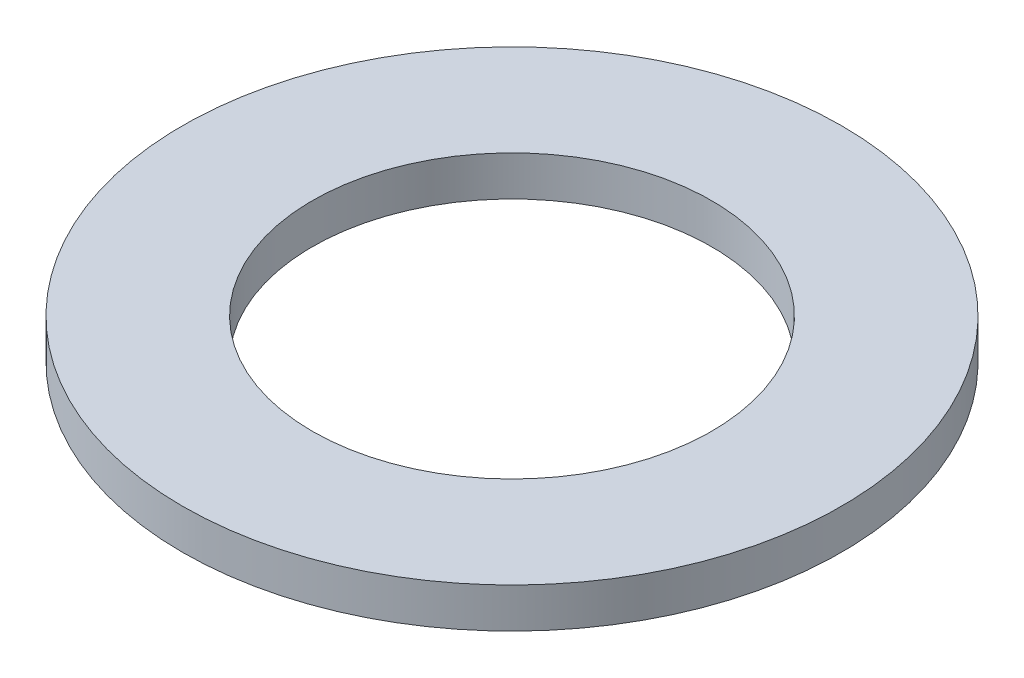
ISO-10303-21;
HEADER;
FILE_DESCRIPTION(('STEP AP214'),'2;1');
FILE_NAME('part.step','',(''),(''),'','','');
FILE_SCHEMA(('AUTOMOTIVE_DESIGN { 1 0 10303 214 1 1 1 1 }'));
ENDSEC;
DATA;
#1=APPLICATION_CONTEXT('core data for automotive mechanical design processes');
#2=APPLICATION_PROTOCOL_DEFINITION('international standard','automotive_design',2000,#1);
#3=PRODUCT_CONTEXT('',#1,'mechanical');
#4=PRODUCT('Part','Part','',(#3));
#5=PRODUCT_RELATED_PRODUCT_CATEGORY('part','',(#4));
#6=PRODUCT_DEFINITION_FORMATION('','',#4);
#7=PRODUCT_DEFINITION_CONTEXT('part definition',#1,'design');
#8=PRODUCT_DEFINITION('design','',#6,#7);
#9=PRODUCT_DEFINITION_SHAPE('','',#8);
#10=(LENGTH_UNIT() NAMED_UNIT(*) SI_UNIT(.MILLI.,.METRE.));
#11=(NAMED_UNIT(*) PLANE_ANGLE_UNIT() SI_UNIT($,.RADIAN.));
#12=(NAMED_UNIT(*) SI_UNIT($,.STERADIAN.) SOLID_ANGLE_UNIT());
#13=UNCERTAINTY_MEASURE_WITH_UNIT(LENGTH_MEASURE(1.E-05),#10,'distance_accuracy_value','');
#14=(GEOMETRIC_REPRESENTATION_CONTEXT(3) GLOBAL_UNCERTAINTY_ASSIGNED_CONTEXT((#13)) GLOBAL_UNIT_ASSIGNED_CONTEXT((#10,
#11,#12)) REPRESENTATION_CONTEXT('',''));
#15=CARTESIAN_POINT('',(0.,0.,0.));
#16=DIRECTION('',(0.,0.,1.));
#17=DIRECTION('',(1.,0.,0.));
#18=AXIS2_PLACEMENT_3D('',#15,#16,#17);
#19=CARTESIAN_POINT('',(0.,10.,0.));
#20=DIRECTION('',(0.,-1.,0.));
#21=DIRECTION('',(0.,0.,-1.));
#22=AXIS2_PLACEMENT_3D('',#19,#20,#21);
#23=CYLINDRICAL_SURFACE('',#22,82.5);
#24=CARTESIAN_POINT('',(0.,10.,0.));
#25=DIRECTION('',(0.,1.,0.));
#26=DIRECTION('',(0.,0.,1.));
#27=AXIS2_PLACEMENT_3D('',#24,#25,#26);
#28=CIRCLE('',#27,82.5);
#29=CARTESIAN_POINT('',(0.,10.,82.5));
#30=VERTEX_POINT('',#29);
#31=EDGE_CURVE('E10',#30,#30,#28,.T.);
#32=ORIENTED_EDGE('',*,*,#31,.F.);
#33=EDGE_LOOP('',(#32));
#34=FACE_BOUND('',#33,.T.);
#35=CARTESIAN_POINT('',(0.,0.,0.));
#36=DIRECTION('',(0.,1.,0.));
#37=DIRECTION('',(0.,0.,1.));
#38=AXIS2_PLACEMENT_3D('',#35,#36,#37);
#39=CIRCLE('',#38,82.5);
#40=CARTESIAN_POINT('',(0.,0.,82.5));
#41=VERTEX_POINT('',#40);
#42=EDGE_CURVE('E37',#41,#41,#39,.T.);
#43=ORIENTED_EDGE('',*,*,#42,.T.);
#44=EDGE_LOOP('',(#43));
#45=FACE_BOUND('',#44,.T.);
#46=ADVANCED_FACE('F40',(#34,#45),#23,.T.);
#47=CARTESIAN_POINT('',(0.,10.,0.));
#48=DIRECTION('',(0.,1.,0.));
#49=DIRECTION('',(0.,0.,1.));
#50=AXIS2_PLACEMENT_3D('',#47,#48,#49);
#51=PLANE('',#50);
#52=CARTESIAN_POINT('',(0.,10.,0.));
#53=DIRECTION('',(0.,1.,0.));
#54=DIRECTION('',(0.,0.,1.));
#55=AXIS2_PLACEMENT_3D('',#52,#53,#54);
#56=CIRCLE('',#55,50.);
#57=CARTESIAN_POINT('',(0.,10.,50.));
#58=VERTEX_POINT('',#57);
#59=EDGE_CURVE('E50',#58,#58,#56,.T.);
#60=ORIENTED_EDGE('',*,*,#59,.F.);
#61=EDGE_LOOP('',(#60));
#62=FACE_BOUND('',#61,.T.);
#63=ORIENTED_EDGE('',*,*,#31,.T.);
#64=EDGE_LOOP('',(#63));
#65=FACE_BOUND('',#64,.T.);
#66=ADVANCED_FACE('F59',(#62,#65),#51,.T.);
#67=CARTESIAN_POINT('',(0.,0.,0.));
#68=DIRECTION('',(0.,1.,0.));
#69=DIRECTION('',(0.,0.,1.));
#70=AXIS2_PLACEMENT_3D('',#67,#68,#69);
#71=PLANE('',#70);
#72=CARTESIAN_POINT('',(0.,0.,0.));
#73=DIRECTION('',(0.,1.,0.));
#74=DIRECTION('',(0.,0.,1.));
#75=AXIS2_PLACEMENT_3D('',#72,#73,#74);
#76=CIRCLE('',#75,50.);
#77=CARTESIAN_POINT('',(0.,0.,50.));
#78=VERTEX_POINT('',#77);
#79=EDGE_CURVE('E47',#78,#78,#76,.T.);
#80=ORIENTED_EDGE('',*,*,#79,.T.);
#81=EDGE_LOOP('',(#80));
#82=FACE_BOUND('',#81,.T.);
#83=ORIENTED_EDGE('',*,*,#42,.F.);
#84=EDGE_LOOP('',(#83));
#85=FACE_BOUND('',#84,.T.);
#86=ADVANCED_FACE('F58',(#82,#85),#71,.F.);
#87=CARTESIAN_POINT('',(0.,10.,0.));
#88=DIRECTION('',(0.,-1.,0.));
#89=DIRECTION('',(0.,0.,-1.));
#90=AXIS2_PLACEMENT_3D('',#87,#88,#89);
#91=CYLINDRICAL_SURFACE('',#90,50.);
#92=ORIENTED_EDGE('',*,*,#59,.T.);
#93=EDGE_LOOP('',(#92));
#94=FACE_BOUND('',#93,.T.);
#95=ORIENTED_EDGE('',*,*,#79,.F.);
#96=EDGE_LOOP('',(#95));
#97=FACE_BOUND('',#96,.T.);
#98=ADVANCED_FACE('F54',(#94,#97),#91,.F.);
#99=CLOSED_SHELL('',(#46,#66,#86,#98));
#100=MANIFOLD_SOLID_BREP('B2',#99);
#101=ADVANCED_BREP_SHAPE_REPRESENTATION('',(#18,#100),#14);
#102=SHAPE_DEFINITION_REPRESENTATION(#9,#101);
ENDSEC;
END-ISO-10303-21;
